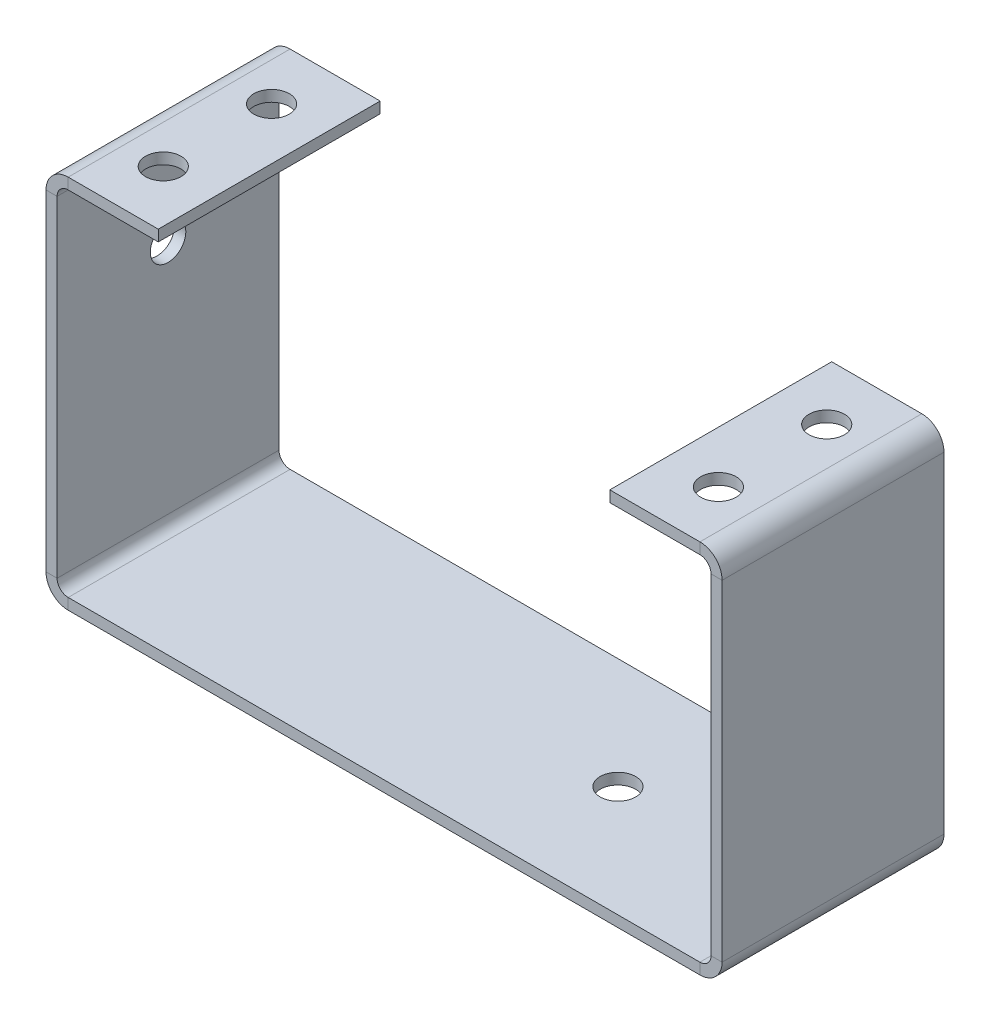
ISO-10303-21;
HEADER;
FILE_DESCRIPTION(('STEP AP214'),'2;1');
FILE_NAME('part.step','',(''),(''),'','','');
FILE_SCHEMA(('AUTOMOTIVE_DESIGN { 1 0 10303 214 1 1 1 1 }'));
ENDSEC;
DATA;
#1=APPLICATION_CONTEXT('core data for automotive mechanical design processes');
#2=APPLICATION_PROTOCOL_DEFINITION('international standard','automotive_design',2000,#1);
#3=PRODUCT_CONTEXT('',#1,'mechanical');
#4=PRODUCT('Part','Part','',(#3));
#5=PRODUCT_RELATED_PRODUCT_CATEGORY('part','',(#4));
#6=PRODUCT_DEFINITION_FORMATION('','',#4);
#7=PRODUCT_DEFINITION_CONTEXT('part definition',#1,'design');
#8=PRODUCT_DEFINITION('design','',#6,#7);
#9=PRODUCT_DEFINITION_SHAPE('','',#8);
#10=(LENGTH_UNIT() NAMED_UNIT(*) SI_UNIT(.MILLI.,.METRE.));
#11=(NAMED_UNIT(*) PLANE_ANGLE_UNIT() SI_UNIT($,.RADIAN.));
#12=(NAMED_UNIT(*) SI_UNIT($,.STERADIAN.) SOLID_ANGLE_UNIT());
#13=UNCERTAINTY_MEASURE_WITH_UNIT(LENGTH_MEASURE(1.E-05),#10,'distance_accuracy_value','');
#14=(GEOMETRIC_REPRESENTATION_CONTEXT(3) GLOBAL_UNCERTAINTY_ASSIGNED_CONTEXT((#13)) GLOBAL_UNIT_ASSIGNED_CONTEXT((#10,
#11,#12)) REPRESENTATION_CONTEXT('',''));
#15=CARTESIAN_POINT('',(0.,0.,0.));
#16=DIRECTION('',(0.,0.,1.));
#17=DIRECTION('',(1.,0.,0.));
#18=AXIS2_PLACEMENT_3D('',#15,#16,#17);
#19=CARTESIAN_POINT('',(5.44999999999998,32.81,-5.11999999999999));
#20=DIRECTION('',(0.,1.,0.));
#21=DIRECTION('',(0.,0.,1.));
#22=AXIS2_PLACEMENT_3D('',#19,#20,#21);
#23=CYLINDRICAL_SURFACE('',#22,1.6);
#24=CARTESIAN_POINT('',(5.44999999999998,32.81,-5.11999999999999));
#25=DIRECTION('',(0.,1.,0.));
#26=DIRECTION('',(0.,0.,1.));
#27=AXIS2_PLACEMENT_3D('',#24,#25,#26);
#28=CIRCLE('',#27,1.6);
#29=CARTESIAN_POINT('',(5.44999999999998,32.81,-3.52));
#30=VERTEX_POINT('',#29);
#31=EDGE_CURVE('E281',#30,#30,#28,.T.);
#32=ORIENTED_EDGE('',*,*,#31,.F.);
#33=EDGE_LOOP('',(#32));
#34=FACE_BOUND('',#33,.T.);
#35=CARTESIAN_POINT('',(5.44999999999998,33.81,-5.11999999999999));
#36=DIRECTION('',(0.,1.,0.));
#37=DIRECTION('',(0.,0.,1.));
#38=AXIS2_PLACEMENT_3D('',#35,#36,#37);
#39=CIRCLE('',#38,1.6);
#40=CARTESIAN_POINT('',(5.44999999999998,33.81,-3.52));
#41=VERTEX_POINT('',#40);
#42=EDGE_CURVE('E309',#41,#41,#39,.T.);
#43=ORIENTED_EDGE('',*,*,#42,.T.);
#44=EDGE_LOOP('',(#43));
#45=FACE_BOUND('',#44,.T.);
#46=ADVANCED_FACE('F39',(#34,#45),#23,.F.);
#47=CARTESIAN_POINT('',(5.44999999999998,32.81,-14.88));
#48=DIRECTION('',(0.,1.,0.));
#49=DIRECTION('',(0.,0.,1.));
#50=AXIS2_PLACEMENT_3D('',#47,#48,#49);
#51=CYLINDRICAL_SURFACE('',#50,1.6);
#52=CARTESIAN_POINT('',(5.44999999999998,32.81,-14.88));
#53=DIRECTION('',(0.,1.,0.));
#54=DIRECTION('',(0.,0.,1.));
#55=AXIS2_PLACEMENT_3D('',#52,#53,#54);
#56=CIRCLE('',#55,1.6);
#57=CARTESIAN_POINT('',(5.44999999999998,32.81,-13.28));
#58=VERTEX_POINT('',#57);
#59=EDGE_CURVE('E284',#58,#58,#56,.T.);
#60=ORIENTED_EDGE('',*,*,#59,.F.);
#61=EDGE_LOOP('',(#60));
#62=FACE_BOUND('',#61,.T.);
#63=CARTESIAN_POINT('',(5.44999999999998,33.81,-14.88));
#64=DIRECTION('',(0.,1.,0.));
#65=DIRECTION('',(0.,0.,1.));
#66=AXIS2_PLACEMENT_3D('',#63,#64,#65);
#67=CIRCLE('',#66,1.6);
#68=CARTESIAN_POINT('',(5.44999999999998,33.81,-13.28));
#69=VERTEX_POINT('',#68);
#70=EDGE_CURVE('E306',#69,#69,#67,.T.);
#71=ORIENTED_EDGE('',*,*,#70,.T.);
#72=EDGE_LOOP('',(#71));
#73=FACE_BOUND('',#72,.T.);
#74=ADVANCED_FACE('F550',(#62,#73),#51,.F.);
#75=CARTESIAN_POINT('',(10.12,-10.361027321573,0.));
#76=DIRECTION('',(1.,0.,0.));
#77=DIRECTION('',(0.,1.,0.));
#78=AXIS2_PLACEMENT_3D('',#75,#76,#77);
#79=PLANE('',#78);
#80=DIRECTION('',(0.,1.,0.));
#81=VECTOR('',#80,1.);
#82=CARTESIAN_POINT('',(10.12,-10.361027321573,-20.));
#83=LINE('',#82,#81);
#84=CARTESIAN_POINT('',(10.12,32.81,-20.));
#85=VERTEX_POINT('',#84);
#86=CARTESIAN_POINT('',(10.12,33.81,-20.));
#87=VERTEX_POINT('',#86);
#88=EDGE_CURVE('E303',#85,#87,#83,.T.);
#89=ORIENTED_EDGE('',*,*,#88,.T.);
#90=DIRECTION('',(0.,0.,1.));
#91=VECTOR('',#90,1.);
#92=CARTESIAN_POINT('',(10.12,33.81,0.));
#93=LINE('',#92,#91);
#94=CARTESIAN_POINT('',(10.12,33.81,0.));
#95=VERTEX_POINT('',#94);
#96=EDGE_CURVE('E300',#87,#95,#93,.T.);
#97=ORIENTED_EDGE('',*,*,#96,.T.);
#98=DIRECTION('',(0.,1.,0.));
#99=VECTOR('',#98,1.);
#100=CARTESIAN_POINT('',(10.12,-10.361027321573,0.));
#101=LINE('',#100,#99);
#102=CARTESIAN_POINT('',(10.12,32.81,0.));
#103=VERTEX_POINT('',#102);
#104=EDGE_CURVE('E287',#103,#95,#101,.T.);
#105=ORIENTED_EDGE('',*,*,#104,.F.);
#106=DIRECTION('',(0.,0.,-1.));
#107=VECTOR('',#106,1.);
#108=CARTESIAN_POINT('',(10.12,32.81,0.));
#109=LINE('',#108,#107);
#110=EDGE_CURVE('E58',#103,#85,#109,.T.);
#111=ORIENTED_EDGE('',*,*,#110,.T.);
#112=EDGE_LOOP('',(#89,#97,#105,#111));
#113=FACE_BOUND('',#112,.T.);
#114=ADVANCED_FACE('F556',(#113),#79,.T.);
#115=CARTESIAN_POINT('',(10.12,-10.361027321573,-20.));
#116=DIRECTION('',(0.,0.,-1.));
#117=DIRECTION('',(1.,0.,0.));
#118=AXIS2_PLACEMENT_3D('',#115,#116,#117);
#119=PLANE('',#118);
#120=DIRECTION('',(0.,1.,0.));
#121=VECTOR('',#120,1.);
#122=CARTESIAN_POINT('',(1.99999999999998,-10.361027321573,-20.));
#123=LINE('',#122,#121);
#124=CARTESIAN_POINT('',(1.99999999999998,32.81,-20.));
#125=VERTEX_POINT('',#124);
#126=CARTESIAN_POINT('',(1.99999999999998,33.81,-20.));
#127=VERTEX_POINT('',#126);
#128=EDGE_CURVE('E296',#125,#127,#123,.T.);
#129=ORIENTED_EDGE('',*,*,#128,.T.);
#130=DIRECTION('',(-1.,0.,0.));
#131=VECTOR('',#130,1.);
#132=CARTESIAN_POINT('',(0.,33.81,-20.));
#133=LINE('',#132,#131);
#134=EDGE_CURVE('E289',#87,#127,#133,.T.);
#135=ORIENTED_EDGE('',*,*,#134,.F.);
#136=ORIENTED_EDGE('',*,*,#88,.F.);
#137=DIRECTION('',(-1.,0.,0.));
#138=VECTOR('',#137,1.);
#139=CARTESIAN_POINT('',(10.12,32.81,-20.));
#140=LINE('',#139,#138);
#141=EDGE_CURVE('E294',#85,#125,#140,.T.);
#142=ORIENTED_EDGE('',*,*,#141,.T.);
#143=EDGE_LOOP('',(#129,#135,#136,#142));
#144=FACE_BOUND('',#143,.T.);
#145=ADVANCED_FACE('F566',(#144),#119,.T.);
#146=CARTESIAN_POINT('',(0.,33.81,0.));
#147=DIRECTION('',(0.,1.,0.));
#148=DIRECTION('',(0.,0.,1.));
#149=AXIS2_PLACEMENT_3D('',#146,#147,#148);
#150=PLANE('',#149);
#151=DIRECTION('',(0.,0.,-1.));
#152=VECTOR('',#151,1.);
#153=CARTESIAN_POINT('',(1.99999999999999,33.81,-20.));
#154=LINE('',#153,#152);
#155=CARTESIAN_POINT('',(1.99999999999999,33.81,0.));
#156=VERTEX_POINT('',#155);
#157=EDGE_CURVE('E211',#156,#127,#154,.T.);
#158=ORIENTED_EDGE('',*,*,#157,.F.);
#159=DIRECTION('',(1.,0.,0.));
#160=VECTOR('',#159,1.);
#161=CARTESIAN_POINT('',(10.12,33.81,0.));
#162=LINE('',#161,#160);
#163=EDGE_CURVE('E291',#156,#95,#162,.T.);
#164=ORIENTED_EDGE('',*,*,#163,.T.);
#165=ORIENTED_EDGE('',*,*,#96,.F.);
#166=ORIENTED_EDGE('',*,*,#134,.T.);
#167=EDGE_LOOP('',(#158,#164,#165,#166));
#168=FACE_BOUND('',#167,.T.);
#169=ORIENTED_EDGE('',*,*,#70,.F.);
#170=EDGE_LOOP('',(#169));
#171=FACE_BOUND('',#170,.T.);
#172=ORIENTED_EDGE('',*,*,#42,.F.);
#173=EDGE_LOOP('',(#172));
#174=FACE_BOUND('',#173,.T.);
#175=ADVANCED_FACE('F570',(#168,#171,#174),#150,.T.);
#176=CARTESIAN_POINT('',(10.12,-10.361027321573,0.));
#177=DIRECTION('',(0.,0.,-1.));
#178=DIRECTION('',(1.,0.,0.));
#179=AXIS2_PLACEMENT_3D('',#176,#177,#178);
#180=PLANE('',#179);
#181=ORIENTED_EDGE('',*,*,#163,.F.);
#182=DIRECTION('',(0.,1.,0.));
#183=VECTOR('',#182,1.);
#184=CARTESIAN_POINT('',(1.99999999999998,-10.361027321573,0.));
#185=LINE('',#184,#183);
#186=CARTESIAN_POINT('',(1.99999999999999,32.81,0.));
#187=VERTEX_POINT('',#186);
#188=EDGE_CURVE('E43',#187,#156,#185,.T.);
#189=ORIENTED_EDGE('',*,*,#188,.F.);
#190=DIRECTION('',(-1.,0.,0.));
#191=VECTOR('',#190,1.);
#192=CARTESIAN_POINT('',(10.12,32.81,0.));
#193=LINE('',#192,#191);
#194=EDGE_CURVE('E49',#103,#187,#193,.T.);
#195=ORIENTED_EDGE('',*,*,#194,.F.);
#196=ORIENTED_EDGE('',*,*,#104,.T.);
#197=EDGE_LOOP('',(#181,#189,#195,#196));
#198=FACE_BOUND('',#197,.T.);
#199=ADVANCED_FACE('F573',(#198),#180,.F.);
#200=CARTESIAN_POINT('',(10.12,32.81,0.));
#201=DIRECTION('',(0.,1.,0.));
#202=DIRECTION('',(0.,0.,1.));
#203=AXIS2_PLACEMENT_3D('',#200,#201,#202);
#204=PLANE('',#203);
#205=ORIENTED_EDGE('',*,*,#59,.T.);
#206=EDGE_LOOP('',(#205));
#207=FACE_BOUND('',#206,.T.);
#208=ORIENTED_EDGE('',*,*,#31,.T.);
#209=EDGE_LOOP('',(#208));
#210=FACE_BOUND('',#209,.T.);
#211=ORIENTED_EDGE('',*,*,#194,.T.);
#212=DIRECTION('',(0.,0.,-1.));
#213=VECTOR('',#212,1.);
#214=CARTESIAN_POINT('',(1.99999999999999,32.81,-20.));
#215=LINE('',#214,#213);
#216=EDGE_CURVE('E11',#187,#125,#215,.T.);
#217=ORIENTED_EDGE('',*,*,#216,.T.);
#218=ORIENTED_EDGE('',*,*,#141,.F.);
#219=ORIENTED_EDGE('',*,*,#110,.F.);
#220=EDGE_LOOP('',(#211,#217,#218,#219));
#221=FACE_BOUND('',#220,.T.);
#222=ADVANCED_FACE('F41',(#207,#210,#221),#204,.F.);
#223=CARTESIAN_POINT('',(55.49,32.81,-5.11999999999995));
#224=DIRECTION('',(0.,1.,0.));
#225=DIRECTION('',(0.,0.,1.));
#226=AXIS2_PLACEMENT_3D('',#223,#224,#225);
#227=CYLINDRICAL_SURFACE('',#226,1.6);
#228=CARTESIAN_POINT('',(55.49,32.81,-5.11999999999995));
#229=DIRECTION('',(0.,1.,0.));
#230=DIRECTION('',(0.,0.,1.));
#231=AXIS2_PLACEMENT_3D('',#228,#229,#230);
#232=CIRCLE('',#231,1.6);
#233=CARTESIAN_POINT('',(55.49,32.81,-3.51999999999996));
#234=VERTEX_POINT('',#233);
#235=EDGE_CURVE('E245',#234,#234,#232,.T.);
#236=ORIENTED_EDGE('',*,*,#235,.F.);
#237=EDGE_LOOP('',(#236));
#238=FACE_BOUND('',#237,.T.);
#239=CARTESIAN_POINT('',(55.49,33.81,-5.11999999999995));
#240=DIRECTION('',(0.,1.,0.));
#241=DIRECTION('',(0.,0.,1.));
#242=AXIS2_PLACEMENT_3D('',#239,#240,#241);
#243=CIRCLE('',#242,1.6);
#244=CARTESIAN_POINT('',(55.49,33.81,-3.51999999999996));
#245=VERTEX_POINT('',#244);
#246=EDGE_CURVE('E273',#245,#245,#243,.T.);
#247=ORIENTED_EDGE('',*,*,#246,.T.);
#248=EDGE_LOOP('',(#247));
#249=FACE_BOUND('',#248,.T.);
#250=ADVANCED_FACE('F580',(#238,#249),#227,.F.);
#251=CARTESIAN_POINT('',(55.49,32.81,-14.88));
#252=DIRECTION('',(0.,1.,0.));
#253=DIRECTION('',(0.,0.,1.));
#254=AXIS2_PLACEMENT_3D('',#251,#252,#253);
#255=CYLINDRICAL_SURFACE('',#254,1.6);
#256=CARTESIAN_POINT('',(55.49,32.81,-14.88));
#257=DIRECTION('',(0.,1.,0.));
#258=DIRECTION('',(0.,0.,1.));
#259=AXIS2_PLACEMENT_3D('',#256,#257,#258);
#260=CIRCLE('',#259,1.6);
#261=CARTESIAN_POINT('',(55.49,32.81,-13.28));
#262=VERTEX_POINT('',#261);
#263=EDGE_CURVE('E248',#262,#262,#260,.T.);
#264=ORIENTED_EDGE('',*,*,#263,.F.);
#265=EDGE_LOOP('',(#264));
#266=FACE_BOUND('',#265,.T.);
#267=CARTESIAN_POINT('',(55.49,33.81,-14.88));
#268=DIRECTION('',(0.,1.,0.));
#269=DIRECTION('',(0.,0.,1.));
#270=AXIS2_PLACEMENT_3D('',#267,#268,#269);
#271=CIRCLE('',#270,1.6);
#272=CARTESIAN_POINT('',(55.49,33.81,-13.28));
#273=VERTEX_POINT('',#272);
#274=EDGE_CURVE('E270',#273,#273,#271,.T.);
#275=ORIENTED_EDGE('',*,*,#274,.T.);
#276=EDGE_LOOP('',(#275));
#277=FACE_BOUND('',#276,.T.);
#278=ADVANCED_FACE('F593',(#266,#277),#255,.F.);
#279=CARTESIAN_POINT('',(50.82,-10.361027321573,-20.));
#280=DIRECTION('',(-1.,0.,0.));
#281=DIRECTION('',(0.,-1.,0.));
#282=AXIS2_PLACEMENT_3D('',#279,#280,#281);
#283=PLANE('',#282);
#284=DIRECTION('',(0.,0.,-1.));
#285=VECTOR('',#284,1.);
#286=CARTESIAN_POINT('',(50.82,33.81,-20.));
#287=LINE('',#286,#285);
#288=CARTESIAN_POINT('',(50.82,33.81,0.));
#289=VERTEX_POINT('',#288);
#290=CARTESIAN_POINT('',(50.82,33.81,-20.));
#291=VERTEX_POINT('',#290);
#292=EDGE_CURVE('E100',#289,#291,#287,.T.);
#293=ORIENTED_EDGE('',*,*,#292,.T.);
#294=DIRECTION('',(0.,1.,0.));
#295=VECTOR('',#294,1.);
#296=CARTESIAN_POINT('',(50.82,-10.361027321573,-20.));
#297=LINE('',#296,#295);
#298=CARTESIAN_POINT('',(50.82,32.81,-20.));
#299=VERTEX_POINT('',#298);
#300=EDGE_CURVE('E252',#299,#291,#297,.T.);
#301=ORIENTED_EDGE('',*,*,#300,.F.);
#302=DIRECTION('',(0.,0.,1.));
#303=VECTOR('',#302,1.);
#304=CARTESIAN_POINT('',(50.82,32.81,-20.));
#305=LINE('',#304,#303);
#306=CARTESIAN_POINT('',(50.82,32.81,0.));
#307=VERTEX_POINT('',#306);
#308=EDGE_CURVE('E85',#299,#307,#305,.T.);
#309=ORIENTED_EDGE('',*,*,#308,.T.);
#310=DIRECTION('',(0.,1.,0.));
#311=VECTOR('',#310,1.);
#312=CARTESIAN_POINT('',(50.82,-10.361027321573,0.));
#313=LINE('',#312,#311);
#314=EDGE_CURVE('E265',#307,#289,#313,.T.);
#315=ORIENTED_EDGE('',*,*,#314,.T.);
#316=EDGE_LOOP('',(#293,#301,#309,#315));
#317=FACE_BOUND('',#316,.T.);
#318=ADVANCED_FACE('F601',(#317),#283,.T.);
#319=CARTESIAN_POINT('',(50.82,-10.361027321573,0.));
#320=DIRECTION('',(0.,0.,1.));
#321=DIRECTION('',(-1.,0.,0.));
#322=AXIS2_PLACEMENT_3D('',#319,#320,#321);
#323=PLANE('',#322);
#324=DIRECTION('',(1.,0.,0.));
#325=VECTOR('',#324,1.);
#326=CARTESIAN_POINT('',(60.94,33.81,0.));
#327=LINE('',#326,#325);
#328=CARTESIAN_POINT('',(58.94,33.81,0.));
#329=VERTEX_POINT('',#328);
#330=EDGE_CURVE('E257',#289,#329,#327,.T.);
#331=ORIENTED_EDGE('',*,*,#330,.F.);
#332=ORIENTED_EDGE('',*,*,#314,.F.);
#333=DIRECTION('',(1.,0.,0.));
#334=VECTOR('',#333,1.);
#335=CARTESIAN_POINT('',(50.82,32.81,0.));
#336=LINE('',#335,#334);
#337=CARTESIAN_POINT('',(58.94,32.81,0.));
#338=VERTEX_POINT('',#337);
#339=EDGE_CURVE('E262',#307,#338,#336,.T.);
#340=ORIENTED_EDGE('',*,*,#339,.T.);
#341=DIRECTION('',(0.,1.,0.));
#342=VECTOR('',#341,1.);
#343=CARTESIAN_POINT('',(58.94,-10.361027321573,0.));
#344=LINE('',#343,#342);
#345=EDGE_CURVE('E259',#338,#329,#344,.T.);
#346=ORIENTED_EDGE('',*,*,#345,.T.);
#347=EDGE_LOOP('',(#331,#332,#340,#346));
#348=FACE_BOUND('',#347,.T.);
#349=ADVANCED_FACE('F609',(#348),#323,.T.);
#350=CARTESIAN_POINT('',(0.,33.81,0.));
#351=DIRECTION('',(0.,-1.,0.));
#352=DIRECTION('',(0.,0.,-1.));
#353=AXIS2_PLACEMENT_3D('',#350,#351,#352);
#354=PLANE('',#353);
#355=ORIENTED_EDGE('',*,*,#274,.F.);
#356=EDGE_LOOP('',(#355));
#357=FACE_BOUND('',#356,.T.);
#358=ORIENTED_EDGE('',*,*,#246,.F.);
#359=EDGE_LOOP('',(#358));
#360=FACE_BOUND('',#359,.T.);
#361=ORIENTED_EDGE('',*,*,#330,.T.);
#362=DIRECTION('',(0.,0.,-1.));
#363=VECTOR('',#362,1.);
#364=CARTESIAN_POINT('',(58.94,33.81,0.));
#365=LINE('',#364,#363);
#366=CARTESIAN_POINT('',(58.94,33.81,-20.));
#367=VERTEX_POINT('',#366);
#368=EDGE_CURVE('E255',#329,#367,#365,.T.);
#369=ORIENTED_EDGE('',*,*,#368,.T.);
#370=DIRECTION('',(1.,0.,0.));
#371=VECTOR('',#370,1.);
#372=CARTESIAN_POINT('',(50.82,33.81,-20.));
#373=LINE('',#372,#371);
#374=EDGE_CURVE('E105',#291,#367,#373,.T.);
#375=ORIENTED_EDGE('',*,*,#374,.F.);
#376=ORIENTED_EDGE('',*,*,#292,.F.);
#377=EDGE_LOOP('',(#361,#369,#375,#376));
#378=FACE_BOUND('',#377,.T.);
#379=ADVANCED_FACE('F524',(#357,#360,#378),#354,.F.);
#380=CARTESIAN_POINT('',(50.82,-10.361027321573,-20.));
#381=DIRECTION('',(0.,0.,1.));
#382=DIRECTION('',(-1.,0.,0.));
#383=AXIS2_PLACEMENT_3D('',#380,#381,#382);
#384=PLANE('',#383);
#385=ORIENTED_EDGE('',*,*,#300,.T.);
#386=ORIENTED_EDGE('',*,*,#374,.T.);
#387=DIRECTION('',(0.,1.,0.));
#388=VECTOR('',#387,1.);
#389=CARTESIAN_POINT('',(58.94,-10.361027321573,-20.));
#390=LINE('',#389,#388);
#391=CARTESIAN_POINT('',(58.94,32.81,-20.));
#392=VERTEX_POINT('',#391);
#393=EDGE_CURVE('E276',#392,#367,#390,.T.);
#394=ORIENTED_EDGE('',*,*,#393,.F.);
#395=DIRECTION('',(1.,0.,0.));
#396=VECTOR('',#395,1.);
#397=CARTESIAN_POINT('',(50.82,32.81,-20.));
#398=LINE('',#397,#396);
#399=EDGE_CURVE('E243',#299,#392,#398,.T.);
#400=ORIENTED_EDGE('',*,*,#399,.F.);
#401=EDGE_LOOP('',(#385,#386,#394,#400));
#402=FACE_BOUND('',#401,.T.);
#403=ADVANCED_FACE('F523',(#402),#384,.F.);
#404=CARTESIAN_POINT('',(50.82,32.81,-20.));
#405=DIRECTION('',(0.,1.,0.));
#406=DIRECTION('',(0.,0.,1.));
#407=AXIS2_PLACEMENT_3D('',#404,#405,#406);
#408=PLANE('',#407);
#409=ORIENTED_EDGE('',*,*,#263,.T.);
#410=EDGE_LOOP('',(#409));
#411=FACE_BOUND('',#410,.T.);
#412=ORIENTED_EDGE('',*,*,#235,.T.);
#413=EDGE_LOOP('',(#412));
#414=FACE_BOUND('',#413,.T.);
#415=ORIENTED_EDGE('',*,*,#399,.T.);
#416=DIRECTION('',(0.,0.,1.));
#417=VECTOR('',#416,1.);
#418=CARTESIAN_POINT('',(58.94,32.81,0.));
#419=LINE('',#418,#417);
#420=EDGE_CURVE('E240',#392,#338,#419,.T.);
#421=ORIENTED_EDGE('',*,*,#420,.T.);
#422=ORIENTED_EDGE('',*,*,#339,.F.);
#423=ORIENTED_EDGE('',*,*,#308,.F.);
#424=EDGE_LOOP('',(#415,#421,#422,#423));
#425=FACE_BOUND('',#424,.T.);
#426=ADVANCED_FACE('F520',(#411,#414,#425),#408,.F.);
#427=CARTESIAN_POINT('',(60.941,23.25,-10.));
#428=DIRECTION('',(-1.,0.,0.));
#429=DIRECTION('',(0.,0.,1.));
#430=AXIS2_PLACEMENT_3D('',#427,#428,#429);
#431=CYLINDRICAL_SURFACE('',#430,1.6);
#432=CARTESIAN_POINT('',(0.,23.25,-10.));
#433=DIRECTION('',(-1.,0.,0.));
#434=DIRECTION('',(0.,0.,1.));
#435=AXIS2_PLACEMENT_3D('',#432,#433,#434);
#436=CIRCLE('',#435,1.6);
#437=CARTESIAN_POINT('',(0.,23.25,-8.4));
#438=VERTEX_POINT('',#437);
#439=EDGE_CURVE('E228',#438,#438,#436,.T.);
#440=ORIENTED_EDGE('',*,*,#439,.T.);
#441=EDGE_LOOP('',(#440));
#442=FACE_BOUND('',#441,.T.);
#443=CARTESIAN_POINT('',(1.,23.25,-10.));
#444=DIRECTION('',(-1.,0.,0.));
#445=DIRECTION('',(0.,0.,1.));
#446=AXIS2_PLACEMENT_3D('',#443,#444,#445);
#447=CIRCLE('',#446,1.6);
#448=CARTESIAN_POINT('',(1.,23.25,-8.4));
#449=VERTEX_POINT('',#448);
#450=EDGE_CURVE('E206',#449,#449,#447,.F.);
#451=ORIENTED_EDGE('',*,*,#450,.T.);
#452=EDGE_LOOP('',(#451));
#453=FACE_BOUND('',#452,.T.);
#454=ADVANCED_FACE('F442',(#442,#453),#431,.F.);
#455=CARTESIAN_POINT('',(72.7951558254455,33.81,-20.));
#456=DIRECTION('',(0.,0.,-1.));
#457=DIRECTION('',(0.,1.,0.));
#458=AXIS2_PLACEMENT_3D('',#455,#456,#457);
#459=PLANE('',#458);
#460=DIRECTION('',(0.,-1.,0.));
#461=VECTOR('',#460,1.);
#462=CARTESIAN_POINT('',(0.,1.,-20.));
#463=LINE('',#462,#461);
#464=CARTESIAN_POINT('',(0.,31.81,-20.));
#465=VERTEX_POINT('',#464);
#466=CARTESIAN_POINT('',(0.,2.00000000000001,-20.));
#467=VERTEX_POINT('',#466);
#468=EDGE_CURVE('E217',#465,#467,#463,.T.);
#469=ORIENTED_EDGE('',*,*,#468,.F.);
#470=DIRECTION('',(-1.,0.,0.));
#471=VECTOR('',#470,1.);
#472=CARTESIAN_POINT('',(72.7951558254455,31.81,-20.));
#473=LINE('',#472,#471);
#474=CARTESIAN_POINT('',(0.99999999999999,31.81,-20.));
#475=VERTEX_POINT('',#474);
#476=EDGE_CURVE('E195',#475,#465,#473,.T.);
#477=ORIENTED_EDGE('',*,*,#476,.F.);
#478=DIRECTION('',(0.,-1.,0.));
#479=VECTOR('',#478,1.);
#480=CARTESIAN_POINT('',(0.999999999999998,33.81,-20.));
#481=LINE('',#480,#479);
#482=CARTESIAN_POINT('',(0.999999999999998,2.,-20.));
#483=VERTEX_POINT('',#482);
#484=EDGE_CURVE('E205',#475,#483,#481,.T.);
#485=ORIENTED_EDGE('',*,*,#484,.T.);
#486=DIRECTION('',(-1.,0.,0.));
#487=VECTOR('',#486,1.);
#488=CARTESIAN_POINT('',(72.7951558254455,2.,-20.));
#489=LINE('',#488,#487);
#490=EDGE_CURVE('E219',#483,#467,#489,.T.);
#491=ORIENTED_EDGE('',*,*,#490,.T.);
#492=EDGE_LOOP('',(#469,#477,#485,#491));
#493=FACE_BOUND('',#492,.T.);
#494=ADVANCED_FACE('F218',(#493),#459,.T.);
#495=CARTESIAN_POINT('',(0.,1.,0.));
#496=DIRECTION('',(1.,0.,0.));
#497=DIRECTION('',(0.,0.,-1.));
#498=AXIS2_PLACEMENT_3D('',#495,#496,#497);
#499=PLANE('',#498);
#500=ORIENTED_EDGE('',*,*,#439,.F.);
#501=EDGE_LOOP('',(#500));
#502=FACE_BOUND('',#501,.T.);
#503=DIRECTION('',(0.,0.,1.));
#504=VECTOR('',#503,1.);
#505=CARTESIAN_POINT('',(0.,31.81,-20.));
#506=LINE('',#505,#504);
#507=CARTESIAN_POINT('',(0.,31.81,0.));
#508=VERTEX_POINT('',#507);
#509=EDGE_CURVE('E111',#465,#508,#506,.T.);
#510=ORIENTED_EDGE('',*,*,#509,.F.);
#511=ORIENTED_EDGE('',*,*,#468,.T.);
#512=DIRECTION('',(0.,0.,1.));
#513=VECTOR('',#512,1.);
#514=CARTESIAN_POINT('',(0.,2.,-20.));
#515=LINE('',#514,#513);
#516=CARTESIAN_POINT('',(0.,2.,0.));
#517=VERTEX_POINT('',#516);
#518=EDGE_CURVE('E222',#467,#517,#515,.T.);
#519=ORIENTED_EDGE('',*,*,#518,.T.);
#520=DIRECTION('',(0.,-1.,0.));
#521=VECTOR('',#520,1.);
#522=CARTESIAN_POINT('',(0.,1.,0.));
#523=LINE('',#522,#521);
#524=EDGE_CURVE('E227',#508,#517,#523,.T.);
#525=ORIENTED_EDGE('',*,*,#524,.F.);
#526=EDGE_LOOP('',(#510,#511,#519,#525));
#527=FACE_BOUND('',#526,.T.);
#528=ADVANCED_FACE('F225',(#502,#527),#499,.F.);
#529=CARTESIAN_POINT('',(72.7951558254455,33.81,0.));
#530=DIRECTION('',(0.,0.,-1.));
#531=DIRECTION('',(0.,1.,0.));
#532=AXIS2_PLACEMENT_3D('',#529,#530,#531);
#533=PLANE('',#532);
#534=DIRECTION('',(-1.,0.,0.));
#535=VECTOR('',#534,1.);
#536=CARTESIAN_POINT('',(72.7951558254455,31.81,0.));
#537=LINE('',#536,#535);
#538=CARTESIAN_POINT('',(0.999999999999991,31.81,0.));
#539=VERTEX_POINT('',#538);
#540=EDGE_CURVE('E435',#539,#508,#537,.T.);
#541=ORIENTED_EDGE('',*,*,#540,.T.);
#542=ORIENTED_EDGE('',*,*,#524,.T.);
#543=DIRECTION('',(-1.,0.,0.));
#544=VECTOR('',#543,1.);
#545=CARTESIAN_POINT('',(72.7951558254455,2.,0.));
#546=LINE('',#545,#544);
#547=CARTESIAN_POINT('',(0.999999999999999,2.,0.));
#548=VERTEX_POINT('',#547);
#549=EDGE_CURVE('E233',#548,#517,#546,.T.);
#550=ORIENTED_EDGE('',*,*,#549,.F.);
#551=DIRECTION('',(0.,-1.,0.));
#552=VECTOR('',#551,1.);
#553=CARTESIAN_POINT('',(1.,33.81,0.));
#554=LINE('',#553,#552);
#555=EDGE_CURVE('E431',#539,#548,#554,.T.);
#556=ORIENTED_EDGE('',*,*,#555,.F.);
#557=EDGE_LOOP('',(#541,#542,#550,#556));
#558=FACE_BOUND('',#557,.T.);
#559=ADVANCED_FACE('F448',(#558),#533,.F.);
#560=CARTESIAN_POINT('',(0.999999999999998,33.81,-20.));
#561=DIRECTION('',(-1.,0.,0.));
#562=DIRECTION('',(0.,0.,1.));
#563=AXIS2_PLACEMENT_3D('',#560,#561,#562);
#564=PLANE('',#563);
#565=ORIENTED_EDGE('',*,*,#450,.F.);
#566=EDGE_LOOP('',(#565));
#567=FACE_BOUND('',#566,.T.);
#568=DIRECTION('',(0.,0.,-1.));
#569=VECTOR('',#568,1.);
#570=CARTESIAN_POINT('',(0.999999999999996,31.81,-20.));
#571=LINE('',#570,#569);
#572=EDGE_CURVE('E229',#539,#475,#571,.T.);
#573=ORIENTED_EDGE('',*,*,#572,.F.);
#574=ORIENTED_EDGE('',*,*,#555,.T.);
#575=DIRECTION('',(0.,0.,-1.));
#576=VECTOR('',#575,1.);
#577=CARTESIAN_POINT('',(0.999999999999998,2.,-20.));
#578=LINE('',#577,#576);
#579=EDGE_CURVE('E278',#548,#483,#578,.T.);
#580=ORIENTED_EDGE('',*,*,#579,.T.);
#581=ORIENTED_EDGE('',*,*,#484,.F.);
#582=EDGE_LOOP('',(#573,#574,#580,#581));
#583=FACE_BOUND('',#582,.T.);
#584=ADVANCED_FACE('F444',(#567,#583),#564,.F.);
#585=CARTESIAN_POINT('',(-11.8551558254455,33.81,0.));
#586=DIRECTION('',(0.,0.,1.));
#587=DIRECTION('',(0.,1.,0.));
#588=AXIS2_PLACEMENT_3D('',#585,#586,#587);
#589=PLANE('',#588);
#590=DIRECTION('',(0.,-1.,0.));
#591=VECTOR('',#590,1.);
#592=CARTESIAN_POINT('',(60.94,0.999999999999966,0.));
#593=LINE('',#592,#591);
#594=CARTESIAN_POINT('',(60.94,31.81,0.));
#595=VERTEX_POINT('',#594);
#596=CARTESIAN_POINT('',(60.94,2.,0.));
#597=VERTEX_POINT('',#596);
#598=EDGE_CURVE('E409',#595,#597,#593,.T.);
#599=ORIENTED_EDGE('',*,*,#598,.F.);
#600=DIRECTION('',(1.,0.,0.));
#601=VECTOR('',#600,1.);
#602=CARTESIAN_POINT('',(-11.8551558254455,31.81,0.));
#603=LINE('',#602,#601);
#604=CARTESIAN_POINT('',(59.94,31.81,0.));
#605=VERTEX_POINT('',#604);
#606=EDGE_CURVE('E418',#605,#595,#603,.T.);
#607=ORIENTED_EDGE('',*,*,#606,.F.);
#608=DIRECTION('',(0.,-1.,0.));
#609=VECTOR('',#608,1.);
#610=CARTESIAN_POINT('',(59.94,33.81,0.));
#611=LINE('',#610,#609);
#612=CARTESIAN_POINT('',(59.94,1.99999999999999,0.));
#613=VERTEX_POINT('',#612);
#614=EDGE_CURVE('E415',#605,#613,#611,.T.);
#615=ORIENTED_EDGE('',*,*,#614,.T.);
#616=DIRECTION('',(1.,0.,0.));
#617=VECTOR('',#616,1.);
#618=CARTESIAN_POINT('',(-11.8551558254455,1.99999999999999,0.));
#619=LINE('',#618,#617);
#620=EDGE_CURVE('E412',#613,#597,#619,.T.);
#621=ORIENTED_EDGE('',*,*,#620,.T.);
#622=EDGE_LOOP('',(#599,#607,#615,#621));
#623=FACE_BOUND('',#622,.T.);
#624=ADVANCED_FACE('F447',(#623),#589,.T.);
#625=CARTESIAN_POINT('',(60.94,0.999999999999966,0.));
#626=DIRECTION('',(-1.,0.,0.));
#627=DIRECTION('',(0.,0.,1.));
#628=AXIS2_PLACEMENT_3D('',#625,#626,#627);
#629=PLANE('',#628);
#630=DIRECTION('',(0.,0.,-1.));
#631=VECTOR('',#630,1.);
#632=CARTESIAN_POINT('',(60.94,31.81,0.));
#633=LINE('',#632,#631);
#634=CARTESIAN_POINT('',(60.94,31.81,-20.));
#635=VERTEX_POINT('',#634);
#636=EDGE_CURVE('E422',#595,#635,#633,.T.);
#637=ORIENTED_EDGE('',*,*,#636,.F.);
#638=ORIENTED_EDGE('',*,*,#598,.T.);
#639=DIRECTION('',(0.,0.,-1.));
#640=VECTOR('',#639,1.);
#641=CARTESIAN_POINT('',(60.94,1.99999999999999,0.));
#642=LINE('',#641,#640);
#643=CARTESIAN_POINT('',(60.94,2.,-20.));
#644=VERTEX_POINT('',#643);
#645=EDGE_CURVE('E406',#597,#644,#642,.T.);
#646=ORIENTED_EDGE('',*,*,#645,.T.);
#647=DIRECTION('',(0.,-1.,0.));
#648=VECTOR('',#647,1.);
#649=CARTESIAN_POINT('',(60.94,0.999999999999994,-20.));
#650=LINE('',#649,#648);
#651=EDGE_CURVE('E398',#635,#644,#650,.T.);
#652=ORIENTED_EDGE('',*,*,#651,.F.);
#653=EDGE_LOOP('',(#637,#638,#646,#652));
#654=FACE_BOUND('',#653,.T.);
#655=ADVANCED_FACE('F534',(#654),#629,.F.);
#656=CARTESIAN_POINT('',(-11.8551558254455,33.81,-20.));
#657=DIRECTION('',(0.,0.,1.));
#658=DIRECTION('',(0.,1.,0.));
#659=AXIS2_PLACEMENT_3D('',#656,#657,#658);
#660=PLANE('',#659);
#661=DIRECTION('',(1.,0.,0.));
#662=VECTOR('',#661,1.);
#663=CARTESIAN_POINT('',(-11.8551558254455,31.81,-20.));
#664=LINE('',#663,#662);
#665=CARTESIAN_POINT('',(59.94,31.81,-20.));
#666=VERTEX_POINT('',#665);
#667=EDGE_CURVE('E403',#666,#635,#664,.T.);
#668=ORIENTED_EDGE('',*,*,#667,.T.);
#669=ORIENTED_EDGE('',*,*,#651,.T.);
#670=DIRECTION('',(1.,0.,0.));
#671=VECTOR('',#670,1.);
#672=CARTESIAN_POINT('',(-11.8551558254455,2.00000000000001,-20.));
#673=LINE('',#672,#671);
#674=CARTESIAN_POINT('',(59.94,2.00000000000001,-20.));
#675=VERTEX_POINT('',#674);
#676=EDGE_CURVE('E392',#675,#644,#673,.T.);
#677=ORIENTED_EDGE('',*,*,#676,.F.);
#678=DIRECTION('',(0.,-1.,0.));
#679=VECTOR('',#678,1.);
#680=CARTESIAN_POINT('',(59.94,33.81,-20.));
#681=LINE('',#680,#679);
#682=EDGE_CURVE('E395',#666,#675,#681,.T.);
#683=ORIENTED_EDGE('',*,*,#682,.F.);
#684=EDGE_LOOP('',(#668,#669,#677,#683));
#685=FACE_BOUND('',#684,.T.);
#686=ADVANCED_FACE('F506',(#685),#660,.F.);
#687=CARTESIAN_POINT('',(59.94,33.81,-20.));
#688=DIRECTION('',(1.,0.,0.));
#689=DIRECTION('',(0.,0.,-1.));
#690=AXIS2_PLACEMENT_3D('',#687,#688,#689);
#691=PLANE('',#690);
#692=DIRECTION('',(0.,0.,1.));
#693=VECTOR('',#692,1.);
#694=CARTESIAN_POINT('',(59.94,31.81,0.));
#695=LINE('',#694,#693);
#696=EDGE_CURVE('E424',#666,#605,#695,.T.);
#697=ORIENTED_EDGE('',*,*,#696,.F.);
#698=ORIENTED_EDGE('',*,*,#682,.T.);
#699=DIRECTION('',(0.,0.,1.));
#700=VECTOR('',#699,1.);
#701=CARTESIAN_POINT('',(59.94,1.99999999999999,0.));
#702=LINE('',#701,#700);
#703=EDGE_CURVE('E239',#675,#613,#702,.T.);
#704=ORIENTED_EDGE('',*,*,#703,.T.);
#705=ORIENTED_EDGE('',*,*,#614,.F.);
#706=EDGE_LOOP('',(#697,#698,#704,#705));
#707=FACE_BOUND('',#706,.T.);
#708=ADVANCED_FACE('F484',(#707),#691,.F.);
#709=CARTESIAN_POINT('',(0.,0.,0.));
#710=DIRECTION('',(0.,-1.,0.));
#711=DIRECTION('',(0.,0.,-1.));
#712=AXIS2_PLACEMENT_3D('',#709,#710,#711);
#713=PLANE('',#712);
#714=CARTESIAN_POINT('',(41.55,0.,-10.));
#715=DIRECTION('',(0.,-1.,0.));
#716=DIRECTION('',(0.,0.,-1.));
#717=AXIS2_PLACEMENT_3D('',#714,#715,#716);
#718=CIRCLE('',#717,1.6);
#719=CARTESIAN_POINT('',(41.55,0.,-11.6));
#720=VERTEX_POINT('',#719);
#721=EDGE_CURVE('E369',#720,#720,#718,.T.);
#722=ORIENTED_EDGE('',*,*,#721,.F.);
#723=EDGE_LOOP('',(#722));
#724=FACE_BOUND('',#723,.T.);
#725=DIRECTION('',(1.,0.,0.));
#726=VECTOR('',#725,1.);
#727=CARTESIAN_POINT('',(0.,0.,0.));
#728=LINE('',#727,#726);
#729=CARTESIAN_POINT('',(2.,0.,0.));
#730=VERTEX_POINT('',#729);
#731=CARTESIAN_POINT('',(58.94,0.,0.));
#732=VERTEX_POINT('',#731);
#733=EDGE_CURVE('E365',#730,#732,#728,.T.);
#734=ORIENTED_EDGE('',*,*,#733,.F.);
#735=DIRECTION('',(0.,0.,-1.));
#736=VECTOR('',#735,1.);
#737=CARTESIAN_POINT('',(2.,0.,-20.));
#738=LINE('',#737,#736);
#739=CARTESIAN_POINT('',(2.,0.,-20.));
#740=VERTEX_POINT('',#739);
#741=EDGE_CURVE('E373',#730,#740,#738,.T.);
#742=ORIENTED_EDGE('',*,*,#741,.T.);
#743=DIRECTION('',(-1.,0.,0.));
#744=VECTOR('',#743,1.);
#745=CARTESIAN_POINT('',(0.,0.,-20.));
#746=LINE('',#745,#744);
#747=CARTESIAN_POINT('',(58.9399999999999,0.,-20.));
#748=VERTEX_POINT('',#747);
#749=EDGE_CURVE('E473',#748,#740,#746,.T.);
#750=ORIENTED_EDGE('',*,*,#749,.F.);
#751=DIRECTION('',(0.,0.,1.));
#752=VECTOR('',#751,1.);
#753=CARTESIAN_POINT('',(58.94,0.,0.));
#754=LINE('',#753,#752);
#755=EDGE_CURVE('E389',#748,#732,#754,.T.);
#756=ORIENTED_EDGE('',*,*,#755,.T.);
#757=EDGE_LOOP('',(#734,#742,#750,#756));
#758=FACE_BOUND('',#757,.T.);
#759=ADVANCED_FACE('F481',(#724,#758),#713,.T.);
#760=CARTESIAN_POINT('',(0.,1.,0.));
#761=DIRECTION('',(0.,-1.,0.));
#762=DIRECTION('',(0.,0.,-1.));
#763=AXIS2_PLACEMENT_3D('',#760,#761,#762);
#764=PLANE('',#763);
#765=CARTESIAN_POINT('',(41.55,1.,-10.));
#766=DIRECTION('',(0.,-1.,0.));
#767=DIRECTION('',(0.,0.,-1.));
#768=AXIS2_PLACEMENT_3D('',#765,#766,#767);
#769=CIRCLE('',#768,1.6);
#770=CARTESIAN_POINT('',(41.55,1.,-11.6));
#771=VERTEX_POINT('',#770);
#772=EDGE_CURVE('E349',#771,#771,#769,.T.);
#773=ORIENTED_EDGE('',*,*,#772,.T.);
#774=EDGE_LOOP('',(#773));
#775=FACE_BOUND('',#774,.T.);
#776=DIRECTION('',(0.,0.,-1.));
#777=VECTOR('',#776,1.);
#778=CARTESIAN_POINT('',(2.,1.,-20.));
#779=LINE('',#778,#777);
#780=CARTESIAN_POINT('',(2.,1.,0.));
#781=VERTEX_POINT('',#780);
#782=CARTESIAN_POINT('',(2.,1.,-20.));
#783=VERTEX_POINT('',#782);
#784=EDGE_CURVE('E370',#781,#783,#779,.T.);
#785=ORIENTED_EDGE('',*,*,#784,.F.);
#786=DIRECTION('',(1.,0.,0.));
#787=VECTOR('',#786,1.);
#788=CARTESIAN_POINT('',(0.,1.,0.));
#789=LINE('',#788,#787);
#790=CARTESIAN_POINT('',(58.94,0.999999999999988,0.));
#791=VERTEX_POINT('',#790);
#792=EDGE_CURVE('E355',#781,#791,#789,.T.);
#793=ORIENTED_EDGE('',*,*,#792,.T.);
#794=DIRECTION('',(0.,0.,1.));
#795=VECTOR('',#794,1.);
#796=CARTESIAN_POINT('',(58.94,1.,0.));
#797=LINE('',#796,#795);
#798=CARTESIAN_POINT('',(58.94,1.,-20.));
#799=VERTEX_POINT('',#798);
#800=EDGE_CURVE('E386',#799,#791,#797,.T.);
#801=ORIENTED_EDGE('',*,*,#800,.F.);
#802=DIRECTION('',(-1.,0.,0.));
#803=VECTOR('',#802,1.);
#804=CARTESIAN_POINT('',(0.,1.,-20.));
#805=LINE('',#804,#803);
#806=EDGE_CURVE('E364',#799,#783,#805,.T.);
#807=ORIENTED_EDGE('',*,*,#806,.T.);
#808=EDGE_LOOP('',(#785,#793,#801,#807));
#809=FACE_BOUND('',#808,.T.);
#810=ADVANCED_FACE('F483',(#775,#809),#764,.F.);
#811=CARTESIAN_POINT('',(41.55,1.,-10.));
#812=DIRECTION('',(0.,-1.,0.));
#813=DIRECTION('',(0.,0.,-1.));
#814=AXIS2_PLACEMENT_3D('',#811,#812,#813);
#815=CYLINDRICAL_SURFACE('',#814,1.6);
#816=ORIENTED_EDGE('',*,*,#772,.F.);
#817=EDGE_LOOP('',(#816));
#818=FACE_BOUND('',#817,.T.);
#819=ORIENTED_EDGE('',*,*,#721,.T.);
#820=EDGE_LOOP('',(#819));
#821=FACE_BOUND('',#820,.T.);
#822=ADVANCED_FACE('F479',(#818,#821),#815,.F.);
#823=CARTESIAN_POINT('',(0.,121.700681025419,-20.));
#824=DIRECTION('',(0.,0.,1.));
#825=DIRECTION('',(1.,0.,0.));
#826=AXIS2_PLACEMENT_3D('',#823,#824,#825);
#827=PLANE('',#826);
#828=ORIENTED_EDGE('',*,*,#749,.T.);
#829=DIRECTION('',(0.,-1.,0.));
#830=VECTOR('',#829,1.);
#831=CARTESIAN_POINT('',(2.,121.700681025419,-20.));
#832=LINE('',#831,#830);
#833=EDGE_CURVE('E384',#783,#740,#832,.T.);
#834=ORIENTED_EDGE('',*,*,#833,.F.);
#835=ORIENTED_EDGE('',*,*,#806,.F.);
#836=DIRECTION('',(0.,-1.,0.));
#837=VECTOR('',#836,1.);
#838=CARTESIAN_POINT('',(58.9399999999999,121.700681025419,-20.));
#839=LINE('',#838,#837);
#840=EDGE_CURVE('E376',#799,#748,#839,.T.);
#841=ORIENTED_EDGE('',*,*,#840,.T.);
#842=EDGE_LOOP('',(#828,#834,#835,#841));
#843=FACE_BOUND('',#842,.T.);
#844=ADVANCED_FACE('F471',(#843),#827,.F.);
#845=CARTESIAN_POINT('',(0.,121.700681025419,0.));
#846=DIRECTION('',(0.,0.,-1.));
#847=DIRECTION('',(-1.,0.,0.));
#848=AXIS2_PLACEMENT_3D('',#845,#846,#847);
#849=PLANE('',#848);
#850=ORIENTED_EDGE('',*,*,#733,.T.);
#851=DIRECTION('',(0.,-1.,0.));
#852=VECTOR('',#851,1.);
#853=CARTESIAN_POINT('',(58.94,121.700681025419,0.));
#854=LINE('',#853,#852);
#855=EDGE_CURVE('E379',#791,#732,#854,.T.);
#856=ORIENTED_EDGE('',*,*,#855,.F.);
#857=ORIENTED_EDGE('',*,*,#792,.F.);
#858=DIRECTION('',(0.,-1.,0.));
#859=VECTOR('',#858,1.);
#860=CARTESIAN_POINT('',(2.,121.700681025419,0.));
#861=LINE('',#860,#859);
#862=EDGE_CURVE('E381',#781,#730,#861,.T.);
#863=ORIENTED_EDGE('',*,*,#862,.T.);
#864=EDGE_LOOP('',(#850,#856,#857,#863));
#865=FACE_BOUND('',#864,.T.);
#866=ADVANCED_FACE('F489',(#865),#849,.F.);
#867=CARTESIAN_POINT('',(58.94,1.99999999999999,0.));
#868=DIRECTION('',(0.,0.,1.));
#869=DIRECTION('',(0.,-1.,0.));
#870=AXIS2_PLACEMENT_3D('',#867,#868,#869);
#871=PLANE('',#870);
#872=ORIENTED_EDGE('',*,*,#620,.F.);
#873=CARTESIAN_POINT('',(58.94,1.99999999999999,0.));
#874=DIRECTION('',(0.,0.,-1.));
#875=DIRECTION('',(-1.,0.,0.));
#876=AXIS2_PLACEMENT_3D('',#873,#874,#875);
#877=CIRCLE('',#876,0.999999999999999);
#878=EDGE_CURVE('E339',#613,#791,#877,.T.);
#879=ORIENTED_EDGE('',*,*,#878,.T.);
#880=ORIENTED_EDGE('',*,*,#855,.T.);
#881=CARTESIAN_POINT('',(58.94,1.99999999999999,0.));
#882=DIRECTION('',(0.,0.,-1.));
#883=DIRECTION('',(-1.,0.,0.));
#884=AXIS2_PLACEMENT_3D('',#881,#882,#883);
#885=CIRCLE('',#884,2.);
#886=EDGE_CURVE('E343',#597,#732,#885,.T.);
#887=ORIENTED_EDGE('',*,*,#886,.F.);
#888=EDGE_LOOP('',(#872,#879,#880,#887));
#889=FACE_BOUND('',#888,.T.);
#890=ADVANCED_FACE('F539',(#889),#871,.T.);
#891=CARTESIAN_POINT('',(58.94,2.,-20.));
#892=DIRECTION('',(0.,0.,-1.));
#893=DIRECTION('',(0.,1.,0.));
#894=AXIS2_PLACEMENT_3D('',#891,#892,#893);
#895=PLANE('',#894);
#896=CARTESIAN_POINT('',(58.94,2.,-20.));
#897=DIRECTION('',(0.,0.,-1.));
#898=DIRECTION('',(-1.,0.,0.));
#899=AXIS2_PLACEMENT_3D('',#896,#897,#898);
#900=CIRCLE('',#899,0.999999999999999);
#901=EDGE_CURVE('E347',#799,#675,#900,.F.);
#902=ORIENTED_EDGE('',*,*,#901,.T.);
#903=ORIENTED_EDGE('',*,*,#676,.T.);
#904=CARTESIAN_POINT('',(58.94,2.,-20.));
#905=DIRECTION('',(0.,0.,-1.));
#906=DIRECTION('',(-1.,0.,0.));
#907=AXIS2_PLACEMENT_3D('',#904,#905,#906);
#908=CIRCLE('',#907,2.);
#909=EDGE_CURVE('E346',#748,#644,#908,.F.);
#910=ORIENTED_EDGE('',*,*,#909,.F.);
#911=ORIENTED_EDGE('',*,*,#840,.F.);
#912=EDGE_LOOP('',(#902,#903,#910,#911));
#913=FACE_BOUND('',#912,.T.);
#914=ADVANCED_FACE('F502',(#913),#895,.T.);
#915=CARTESIAN_POINT('',(58.9400000000001,1.99999999999989,143.627599945102));
#916=DIRECTION('',(0.,0.,-1.));
#917=DIRECTION('',(-1.,0.,0.));
#918=AXIS2_PLACEMENT_3D('',#915,#916,#917);
#919=CYLINDRICAL_SURFACE('',#918,2.);
#920=ORIENTED_EDGE('',*,*,#755,.F.);
#921=ORIENTED_EDGE('',*,*,#909,.T.);
#922=ORIENTED_EDGE('',*,*,#645,.F.);
#923=ORIENTED_EDGE('',*,*,#886,.T.);
#924=EDGE_LOOP('',(#920,#921,#922,#923));
#925=FACE_BOUND('',#924,.T.);
#926=ADVANCED_FACE('F537',(#925),#919,.T.);
#927=CARTESIAN_POINT('',(58.9400000000001,1.99999999999989,143.627599945102));
#928=DIRECTION('',(0.,0.,-1.));
#929=DIRECTION('',(-1.,0.,0.));
#930=AXIS2_PLACEMENT_3D('',#927,#928,#929);
#931=CYLINDRICAL_SURFACE('',#930,0.999999999999999);
#932=ORIENTED_EDGE('',*,*,#800,.T.);
#933=ORIENTED_EDGE('',*,*,#878,.F.);
#934=ORIENTED_EDGE('',*,*,#703,.F.);
#935=ORIENTED_EDGE('',*,*,#901,.F.);
#936=EDGE_LOOP('',(#932,#933,#934,#935));
#937=FACE_BOUND('',#936,.T.);
#938=ADVANCED_FACE('F499',(#937),#931,.F.);
#939=CARTESIAN_POINT('',(2.,2.,-20.));
#940=DIRECTION('',(0.,0.,-1.));
#941=DIRECTION('',(0.,1.,0.));
#942=AXIS2_PLACEMENT_3D('',#939,#940,#941);
#943=PLANE('',#942);
#944=ORIENTED_EDGE('',*,*,#490,.F.);
#945=CARTESIAN_POINT('',(2.,2.,-20.));
#946=DIRECTION('',(0.,0.,1.));
#947=DIRECTION('',(0.,-1.,0.));
#948=AXIS2_PLACEMENT_3D('',#945,#946,#947);
#949=CIRCLE('',#948,1.);
#950=EDGE_CURVE('E329',#483,#783,#949,.T.);
#951=ORIENTED_EDGE('',*,*,#950,.T.);
#952=ORIENTED_EDGE('',*,*,#833,.T.);
#953=CARTESIAN_POINT('',(2.,2.,-20.));
#954=DIRECTION('',(0.,0.,1.));
#955=DIRECTION('',(0.,-1.,0.));
#956=AXIS2_PLACEMENT_3D('',#953,#954,#955);
#957=CIRCLE('',#956,2.);
#958=EDGE_CURVE('E333',#467,#740,#957,.T.);
#959=ORIENTED_EDGE('',*,*,#958,.F.);
#960=EDGE_LOOP('',(#944,#951,#952,#959));
#961=FACE_BOUND('',#960,.T.);
#962=ADVANCED_FACE('F465',(#961),#943,.T.);
#963=CARTESIAN_POINT('',(2.,2.,0.));
#964=DIRECTION('',(0.,0.,1.));
#965=DIRECTION('',(1.,0.,0.));
#966=AXIS2_PLACEMENT_3D('',#963,#964,#965);
#967=PLANE('',#966);
#968=CARTESIAN_POINT('',(2.,2.,0.));
#969=DIRECTION('',(0.,0.,1.));
#970=DIRECTION('',(0.,-1.,0.));
#971=AXIS2_PLACEMENT_3D('',#968,#969,#970);
#972=CIRCLE('',#971,1.);
#973=EDGE_CURVE('E337',#781,#548,#972,.F.);
#974=ORIENTED_EDGE('',*,*,#973,.T.);
#975=ORIENTED_EDGE('',*,*,#549,.T.);
#976=CARTESIAN_POINT('',(2.,2.,0.));
#977=DIRECTION('',(0.,0.,1.));
#978=DIRECTION('',(0.,-1.,0.));
#979=AXIS2_PLACEMENT_3D('',#976,#977,#978);
#980=CIRCLE('',#979,2.);
#981=EDGE_CURVE('E336',#730,#517,#980,.F.);
#982=ORIENTED_EDGE('',*,*,#981,.F.);
#983=ORIENTED_EDGE('',*,*,#862,.F.);
#984=EDGE_LOOP('',(#974,#975,#982,#983));
#985=FACE_BOUND('',#984,.T.);
#986=ADVANCED_FACE('F459',(#985),#967,.T.);
#987=CARTESIAN_POINT('',(1.99999999999999,2.00000000000001,-131.835164395751));
#988=DIRECTION('',(0.,0.,1.));
#989=DIRECTION('',(0.,-1.,0.));
#990=AXIS2_PLACEMENT_3D('',#987,#988,#989);
#991=CYLINDRICAL_SURFACE('',#990,2.);
#992=ORIENTED_EDGE('',*,*,#741,.F.);
#993=ORIENTED_EDGE('',*,*,#981,.T.);
#994=ORIENTED_EDGE('',*,*,#518,.F.);
#995=ORIENTED_EDGE('',*,*,#958,.T.);
#996=EDGE_LOOP('',(#992,#993,#994,#995));
#997=FACE_BOUND('',#996,.T.);
#998=ADVANCED_FACE('F463',(#997),#991,.T.);
#999=CARTESIAN_POINT('',(1.99999999999999,2.00000000000001,-131.835164395751));
#1000=DIRECTION('',(0.,0.,1.));
#1001=DIRECTION('',(0.,-1.,0.));
#1002=AXIS2_PLACEMENT_3D('',#999,#1000,#1001);
#1003=CYLINDRICAL_SURFACE('',#1002,1.);
#1004=ORIENTED_EDGE('',*,*,#784,.T.);
#1005=ORIENTED_EDGE('',*,*,#950,.F.);
#1006=ORIENTED_EDGE('',*,*,#579,.F.);
#1007=ORIENTED_EDGE('',*,*,#973,.F.);
#1008=EDGE_LOOP('',(#1004,#1005,#1006,#1007));
#1009=FACE_BOUND('',#1008,.T.);
#1010=ADVANCED_FACE('F493',(#1009),#1003,.F.);
#1011=CARTESIAN_POINT('',(58.94,31.81,0.));
#1012=DIRECTION('',(0.,0.,1.));
#1013=DIRECTION('',(0.,-1.,0.));
#1014=AXIS2_PLACEMENT_3D('',#1011,#1012,#1013);
#1015=PLANE('',#1014);
#1016=ORIENTED_EDGE('',*,*,#345,.F.);
#1017=CARTESIAN_POINT('',(58.94,31.81,0.));
#1018=DIRECTION('',(0.,0.,-1.));
#1019=DIRECTION('',(0.,1.,0.));
#1020=AXIS2_PLACEMENT_3D('',#1017,#1018,#1019);
#1021=CIRCLE('',#1020,1.00000000000001);
#1022=EDGE_CURVE('E318',#338,#605,#1021,.T.);
#1023=ORIENTED_EDGE('',*,*,#1022,.T.);
#1024=ORIENTED_EDGE('',*,*,#606,.T.);
#1025=CARTESIAN_POINT('',(58.94,31.81,0.));
#1026=DIRECTION('',(0.,0.,-1.));
#1027=DIRECTION('',(0.,1.,0.));
#1028=AXIS2_PLACEMENT_3D('',#1025,#1026,#1027);
#1029=CIRCLE('',#1028,2.00000000000001);
#1030=EDGE_CURVE('E325',#329,#595,#1029,.T.);
#1031=ORIENTED_EDGE('',*,*,#1030,.F.);
#1032=EDGE_LOOP('',(#1016,#1023,#1024,#1031));
#1033=FACE_BOUND('',#1032,.T.);
#1034=ADVANCED_FACE('F530',(#1033),#1015,.T.);
#1035=CARTESIAN_POINT('',(58.94,31.81,-20.));
#1036=DIRECTION('',(0.,0.,-1.));
#1037=DIRECTION('',(0.,1.,0.));
#1038=AXIS2_PLACEMENT_3D('',#1035,#1036,#1037);
#1039=PLANE('',#1038);
#1040=CARTESIAN_POINT('',(58.94,31.81,-20.));
#1041=DIRECTION('',(0.,0.,-1.));
#1042=DIRECTION('',(0.,1.,0.));
#1043=AXIS2_PLACEMENT_3D('',#1040,#1041,#1042);
#1044=CIRCLE('',#1043,1.00000000000001);
#1045=EDGE_CURVE('E320',#666,#392,#1044,.F.);
#1046=ORIENTED_EDGE('',*,*,#1045,.T.);
#1047=ORIENTED_EDGE('',*,*,#393,.T.);
#1048=CARTESIAN_POINT('',(58.94,31.81,-20.));
#1049=DIRECTION('',(0.,0.,-1.));
#1050=DIRECTION('',(0.,1.,0.));
#1051=AXIS2_PLACEMENT_3D('',#1048,#1049,#1050);
#1052=CIRCLE('',#1051,2.00000000000001);
#1053=EDGE_CURVE('E328',#635,#367,#1052,.F.);
#1054=ORIENTED_EDGE('',*,*,#1053,.F.);
#1055=ORIENTED_EDGE('',*,*,#667,.F.);
#1056=EDGE_LOOP('',(#1046,#1047,#1054,#1055));
#1057=FACE_BOUND('',#1056,.T.);
#1058=ADVANCED_FACE('F517',(#1057),#1039,.T.);
#1059=CARTESIAN_POINT('',(58.94,31.8099999999999,76.8232116255392));
#1060=DIRECTION('',(0.,0.,-1.));
#1061=DIRECTION('',(0.,1.,0.));
#1062=AXIS2_PLACEMENT_3D('',#1059,#1060,#1061);
#1063=CYLINDRICAL_SURFACE('',#1062,2.00000000000001);
#1064=ORIENTED_EDGE('',*,*,#636,.T.);
#1065=ORIENTED_EDGE('',*,*,#1053,.T.);
#1066=ORIENTED_EDGE('',*,*,#368,.F.);
#1067=ORIENTED_EDGE('',*,*,#1030,.T.);
#1068=EDGE_LOOP('',(#1064,#1065,#1066,#1067));
#1069=FACE_BOUND('',#1068,.T.);
#1070=ADVANCED_FACE('F527',(#1069),#1063,.T.);
#1071=CARTESIAN_POINT('',(58.94,31.8099999999999,76.8232116255392));
#1072=DIRECTION('',(0.,0.,-1.));
#1073=DIRECTION('',(0.,1.,0.));
#1074=AXIS2_PLACEMENT_3D('',#1071,#1072,#1073);
#1075=CYLINDRICAL_SURFACE('',#1074,1.00000000000001);
#1076=ORIENTED_EDGE('',*,*,#696,.T.);
#1077=ORIENTED_EDGE('',*,*,#1022,.F.);
#1078=ORIENTED_EDGE('',*,*,#420,.F.);
#1079=ORIENTED_EDGE('',*,*,#1045,.F.);
#1080=EDGE_LOOP('',(#1076,#1077,#1078,#1079));
#1081=FACE_BOUND('',#1080,.T.);
#1082=ADVANCED_FACE('F515',(#1081),#1075,.F.);
#1083=CARTESIAN_POINT('',(1.99999999999999,31.81,-20.));
#1084=DIRECTION('',(0.,0.,-1.));
#1085=DIRECTION('',(0.,1.,0.));
#1086=AXIS2_PLACEMENT_3D('',#1083,#1084,#1085);
#1087=PLANE('',#1086);
#1088=ORIENTED_EDGE('',*,*,#128,.F.);
#1089=CARTESIAN_POINT('',(1.99999999999999,31.81,-20.));
#1090=DIRECTION('',(0.,0.,1.));
#1091=DIRECTION('',(1.,0.,0.));
#1092=AXIS2_PLACEMENT_3D('',#1089,#1090,#1091);
#1093=CIRCLE('',#1092,1.);
#1094=EDGE_CURVE('E200',#125,#475,#1093,.T.);
#1095=ORIENTED_EDGE('',*,*,#1094,.T.);
#1096=ORIENTED_EDGE('',*,*,#476,.T.);
#1097=CARTESIAN_POINT('',(1.99999999999999,31.81,-20.));
#1098=DIRECTION('',(0.,0.,1.));
#1099=DIRECTION('',(1.,0.,0.));
#1100=AXIS2_PLACEMENT_3D('',#1097,#1098,#1099);
#1101=CIRCLE('',#1100,2.);
#1102=EDGE_CURVE('E198',#127,#465,#1101,.T.);
#1103=ORIENTED_EDGE('',*,*,#1102,.F.);
#1104=EDGE_LOOP('',(#1088,#1095,#1096,#1103));
#1105=FACE_BOUND('',#1104,.T.);
#1106=ADVANCED_FACE('F197',(#1105),#1087,.T.);
#1107=CARTESIAN_POINT('',(1.99999999999999,31.81,0.));
#1108=DIRECTION('',(0.,0.,1.));
#1109=DIRECTION('',(0.,-1.,0.));
#1110=AXIS2_PLACEMENT_3D('',#1107,#1108,#1109);
#1111=PLANE('',#1110);
#1112=CARTESIAN_POINT('',(1.99999999999999,31.81,0.));
#1113=DIRECTION('',(0.,0.,1.));
#1114=DIRECTION('',(1.,0.,0.));
#1115=AXIS2_PLACEMENT_3D('',#1112,#1113,#1114);
#1116=CIRCLE('',#1115,1.);
#1117=EDGE_CURVE('E213',#539,#187,#1116,.F.);
#1118=ORIENTED_EDGE('',*,*,#1117,.T.);
#1119=ORIENTED_EDGE('',*,*,#188,.T.);
#1120=CARTESIAN_POINT('',(1.99999999999999,31.81,0.));
#1121=DIRECTION('',(0.,0.,1.));
#1122=DIRECTION('',(1.,0.,0.));
#1123=AXIS2_PLACEMENT_3D('',#1120,#1121,#1122);
#1124=CIRCLE('',#1123,2.);
#1125=EDGE_CURVE('E212',#508,#156,#1124,.F.);
#1126=ORIENTED_EDGE('',*,*,#1125,.F.);
#1127=ORIENTED_EDGE('',*,*,#540,.F.);
#1128=EDGE_LOOP('',(#1118,#1119,#1126,#1127));
#1129=FACE_BOUND('',#1128,.T.);
#1130=ADVANCED_FACE('F314',(#1129),#1111,.T.);
#1131=CARTESIAN_POINT('',(1.99999999999999,31.81,-96.8232116255392));
#1132=DIRECTION('',(0.,0.,1.));
#1133=DIRECTION('',(1.,0.,0.));
#1134=AXIS2_PLACEMENT_3D('',#1131,#1132,#1133);
#1135=CYLINDRICAL_SURFACE('',#1134,2.);
#1136=ORIENTED_EDGE('',*,*,#509,.T.);
#1137=ORIENTED_EDGE('',*,*,#1125,.T.);
#1138=ORIENTED_EDGE('',*,*,#157,.T.);
#1139=ORIENTED_EDGE('',*,*,#1102,.T.);
#1140=EDGE_LOOP('',(#1136,#1137,#1138,#1139));
#1141=FACE_BOUND('',#1140,.T.);
#1142=ADVANCED_FACE('F209',(#1141),#1135,.T.);
#1143=CARTESIAN_POINT('',(1.99999999999999,31.81,-96.8232116255392));
#1144=DIRECTION('',(0.,0.,1.));
#1145=DIRECTION('',(1.,0.,0.));
#1146=AXIS2_PLACEMENT_3D('',#1143,#1144,#1145);
#1147=CYLINDRICAL_SURFACE('',#1146,1.);
#1148=ORIENTED_EDGE('',*,*,#572,.T.);
#1149=ORIENTED_EDGE('',*,*,#1094,.F.);
#1150=ORIENTED_EDGE('',*,*,#216,.F.);
#1151=ORIENTED_EDGE('',*,*,#1117,.F.);
#1152=EDGE_LOOP('',(#1148,#1149,#1150,#1151));
#1153=FACE_BOUND('',#1152,.T.);
#1154=ADVANCED_FACE('F454',(#1153),#1147,.F.);
#1155=CLOSED_SHELL('',(#46,#74,#114,#145,#175,#199,#222,#250,#278,#318,#349,#379,#403,#426,#454,
#494,#528,#559,#584,#624,#655,#686,#708,#759,#810,#822,#844,#866,#890,#914,#926,#938,#962,#986,
#998,#1010,#1034,#1058,#1070,#1082,#1106,#1130,#1142,#1154));
#1156=MANIFOLD_SOLID_BREP('B2',#1155);
#1157=ADVANCED_BREP_SHAPE_REPRESENTATION('',(#18,#1156),#14);
#1158=SHAPE_DEFINITION_REPRESENTATION(#9,#1157);
ENDSEC;
END-ISO-10303-21;
